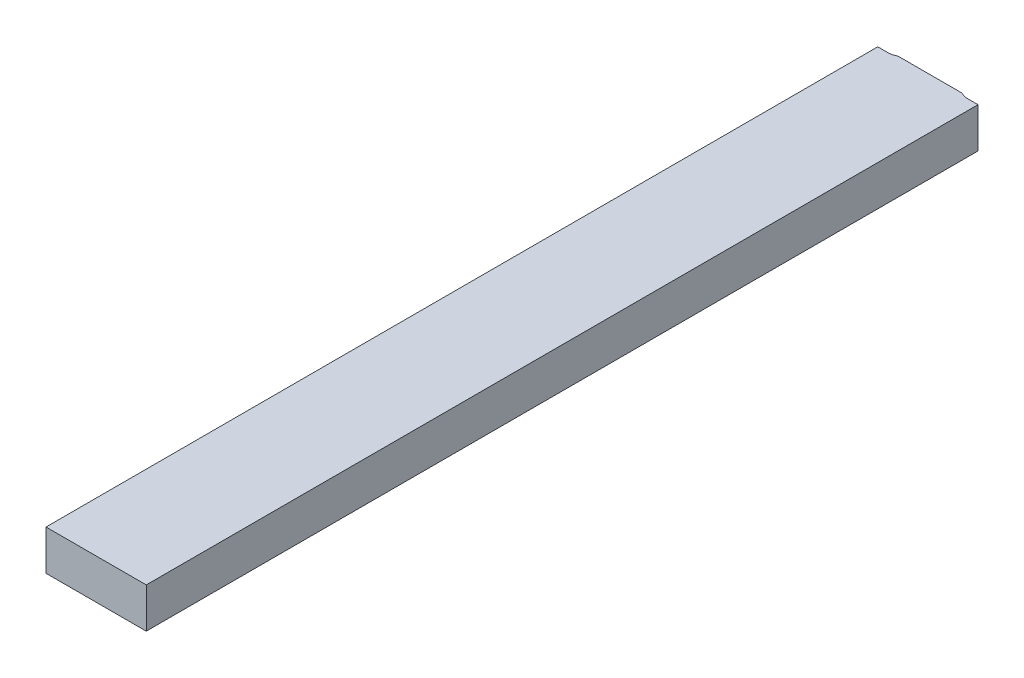
ISO-10303-21;
HEADER;
FILE_DESCRIPTION(('STEP AP214'),'2;1');
FILE_NAME('part.step','',(''),(''),'','','');
FILE_SCHEMA(('AUTOMOTIVE_DESIGN { 1 0 10303 214 1 1 1 1 }'));
ENDSEC;
DATA;
#1=APPLICATION_CONTEXT('core data for automotive mechanical design processes');
#2=APPLICATION_PROTOCOL_DEFINITION('international standard','automotive_design',2000,#1);
#3=PRODUCT_CONTEXT('',#1,'mechanical');
#4=PRODUCT('Part','Part','',(#3));
#5=PRODUCT_RELATED_PRODUCT_CATEGORY('part','',(#4));
#6=PRODUCT_DEFINITION_FORMATION('','',#4);
#7=PRODUCT_DEFINITION_CONTEXT('part definition',#1,'design');
#8=PRODUCT_DEFINITION('design','',#6,#7);
#9=PRODUCT_DEFINITION_SHAPE('','',#8);
#10=(LENGTH_UNIT() NAMED_UNIT(*) SI_UNIT(.MILLI.,.METRE.));
#11=(NAMED_UNIT(*) PLANE_ANGLE_UNIT() SI_UNIT($,.RADIAN.));
#12=(NAMED_UNIT(*) SI_UNIT($,.STERADIAN.) SOLID_ANGLE_UNIT());
#13=UNCERTAINTY_MEASURE_WITH_UNIT(LENGTH_MEASURE(1.E-05),#10,'distance_accuracy_value','');
#14=(GEOMETRIC_REPRESENTATION_CONTEXT(3) GLOBAL_UNCERTAINTY_ASSIGNED_CONTEXT((#13)) GLOBAL_UNIT_ASSIGNED_CONTEXT((#10,
#11,#12)) REPRESENTATION_CONTEXT('',''));
#15=CARTESIAN_POINT('',(0.,0.,0.));
#16=DIRECTION('',(0.,0.,1.));
#17=DIRECTION('',(1.,0.,0.));
#18=AXIS2_PLACEMENT_3D('',#15,#16,#17);
#19=CARTESIAN_POINT('',(-0.5,0.275,-4.982138483572));
#20=DIRECTION('',(0.,1.,0.));
#21=DIRECTION('',(0.,0.,1.));
#22=AXIS2_PLACEMENT_3D('',#19,#20,#21);
#23=PLANE('',#22);
#24=DIRECTION('',(1.,0.,0.));
#25=VECTOR('',#24,1.);
#26=CARTESIAN_POINT('',(-0.725,0.275,-7.051158663985));
#27=LINE('',#26,#25);
#28=CARTESIAN_POINT('',(-0.75,0.275,-7.051158663985));
#29=VERTEX_POINT('',#28);
#30=CARTESIAN_POINT('',(-0.69999999999826,0.275,-7.05115866398515));
#31=VERTEX_POINT('',#30);
#32=EDGE_CURVE('E184',#29,#31,#27,.T.);
#33=ORIENTED_EDGE('',*,*,#32,.T.);
#34=CARTESIAN_POINT('',(-0.660743906178976,0.275,-7.06145062487896));
#35=CARTESIAN_POINT('',(-0.66430562065385,0.275,-7.05943829430757));
#36=CARTESIAN_POINT('',(-0.668023085412866,0.275,-7.05770911017002));
#37=CARTESIAN_POINT('',(-0.675678668397967,0.275,-7.05483826909006));
#38=CARTESIAN_POINT('',(-0.6796167866928,0.275,-7.05369661233069));
#39=CARTESIAN_POINT('',(-0.688999406113005,0.275,-7.05173413514555));
#40=CARTESIAN_POINT('',(-0.694496220016045,0.275,-7.05115865434738));
#41=CARTESIAN_POINT('',(-0.699999999996518,0.275,-7.0511586639853));
#42=B_SPLINE_CURVE_WITH_KNOTS('',3,(#34,#35,#36,#37,#38,#39,#40,#41),.UNSPECIFIED.,.F.,.F.,(4,2,
2,4),(0.,0.0122542009828395,0.0245084057837014,0.0409766482848037),.UNSPECIFIED.);
#43=CARTESIAN_POINT('',(-0.660743906178977,0.275,-7.06145062487897));
#44=VERTEX_POINT('',#43);
#45=EDGE_CURVE('E93',#44,#31,#42,.T.);
#46=ORIENTED_EDGE('',*,*,#45,.F.);
#47=DIRECTION('',(1.,0.,0.));
#48=VECTOR('',#47,1.);
#49=CARTESIAN_POINT('',(-0.4999999517955,0.275,-7.061450624879));
#50=LINE('',#49,#48);
#51=CARTESIAN_POINT('',(-0.339255997411955,0.275,-7.06145062487907));
#52=VERTEX_POINT('',#51);
#53=EDGE_CURVE('E89',#44,#52,#50,.T.);
#54=ORIENTED_EDGE('',*,*,#53,.T.);
#55=CARTESIAN_POINT('',(-0.30000000000351,0.275,-7.05115866398509));
#56=CARTESIAN_POINT('',(-0.304088792772763,0.275,-7.05116284562048));
#57=CARTESIAN_POINT('',(-0.308176113333518,0.275,-7.05148113218099));
#58=CARTESIAN_POINT('',(-0.316256674158179,0.275,-7.05273057454795));
#59=CARTESIAN_POINT('',(-0.32024989952291,0.275,-7.0536618267458));
#60=CARTESIAN_POINT('',(-0.329390827665484,0.275,-7.05654480111919));
#61=CARTESIAN_POINT('',(-0.33446335028931,0.275,-7.05873731135745));
#62=CARTESIAN_POINT('',(-0.33925599741191,0.275,-7.06145062487915));
#63=B_SPLINE_CURVE_WITH_KNOTS('',3,(#55,#56,#57,#58,#59,#60,#61,#62),.UNSPECIFIED.,.F.,.F.,(4,2,
2,4),(0.,0.012252737975001,0.0245074032043933,0.0409759652393869),.UNSPECIFIED.);
#64=CARTESIAN_POINT('',(-0.300000000001755,0.275,-7.05115866398504));
#65=VERTEX_POINT('',#64);
#66=EDGE_CURVE('E21',#65,#52,#63,.T.);
#67=ORIENTED_EDGE('',*,*,#66,.F.);
#68=DIRECTION('',(1.,0.,0.));
#69=VECTOR('',#68,1.);
#70=CARTESIAN_POINT('',(-0.275,0.275,-7.051158663985));
#71=LINE('',#70,#69);
#72=CARTESIAN_POINT('',(-0.25,0.275,-7.051158663985));
#73=VERTEX_POINT('',#72);
#74=EDGE_CURVE('E84',#65,#73,#71,.T.);
#75=ORIENTED_EDGE('',*,*,#74,.T.);
#76=DIRECTION('',(0.,0.,-1.));
#77=VECTOR('',#76,1.);
#78=CARTESIAN_POINT('',(-0.25,0.275,-4.976992503125));
#79=LINE('',#78,#77);
#80=CARTESIAN_POINT('',(-0.25,0.275,-2.902826342264));
#81=VERTEX_POINT('',#80);
#82=EDGE_CURVE('E218',#81,#73,#79,.T.);
#83=ORIENTED_EDGE('',*,*,#82,.F.);
#84=DIRECTION('',(1.,0.,0.));
#85=VECTOR('',#84,1.);
#86=CARTESIAN_POINT('',(-0.5,0.275,-2.902826342264));
#87=LINE('',#86,#85);
#88=CARTESIAN_POINT('',(-0.75,0.275,-2.902826342264));
#89=VERTEX_POINT('',#88);
#90=EDGE_CURVE('E204',#89,#81,#87,.T.);
#91=ORIENTED_EDGE('',*,*,#90,.F.);
#92=DIRECTION('',(0.,0.,-1.));
#93=VECTOR('',#92,1.);
#94=CARTESIAN_POINT('',(-0.75,0.275,-4.976992503125));
#95=LINE('',#94,#93);
#96=EDGE_CURVE('E176',#89,#29,#95,.T.);
#97=ORIENTED_EDGE('',*,*,#96,.T.);
#98=EDGE_LOOP('',(#33,#46,#54,#67,#75,#83,#91,#97));
#99=FACE_BOUND('',#98,.T.);
#100=ADVANCED_FACE('F17',(#99),#23,.F.);
#101=CARTESIAN_POINT('',(-0.25,0.375,-4.976992503125));
#102=DIRECTION('',(1.,0.,0.));
#103=DIRECTION('',(0.,0.,-1.));
#104=AXIS2_PLACEMENT_3D('',#101,#102,#103);
#105=PLANE('',#104);
#106=DIRECTION('',(0.,0.,1.));
#107=VECTOR('',#106,1.);
#108=CARTESIAN_POINT('',(-0.25,0.475,-4.982138483571));
#109=LINE('',#108,#107);
#110=CARTESIAN_POINT('',(-0.25,0.475,-2.902826342264));
#111=VERTEX_POINT('',#110);
#112=CARTESIAN_POINT('',(-0.25,0.475,-7.051158663985));
#113=VERTEX_POINT('',#112);
#114=EDGE_CURVE('E189',#111,#113,#109,.F.);
#115=ORIENTED_EDGE('',*,*,#114,.F.);
#116=DIRECTION('',(0.,1.,0.));
#117=VECTOR('',#116,1.);
#118=CARTESIAN_POINT('',(-0.25,0.375,-2.902826342264));
#119=LINE('',#118,#117);
#120=EDGE_CURVE('E203',#81,#111,#119,.T.);
#121=ORIENTED_EDGE('',*,*,#120,.F.);
#122=ORIENTED_EDGE('',*,*,#82,.T.);
#123=DIRECTION('',(0.,1.,0.));
#124=VECTOR('',#123,1.);
#125=CARTESIAN_POINT('',(-0.25,0.375,-7.051158663985));
#126=LINE('',#125,#124);
#127=EDGE_CURVE('E233',#73,#113,#126,.T.);
#128=ORIENTED_EDGE('',*,*,#127,.T.);
#129=EDGE_LOOP('',(#115,#121,#122,#128));
#130=FACE_BOUND('',#129,.T.);
#131=ADVANCED_FACE('F238',(#130),#105,.T.);
#132=CARTESIAN_POINT('',(-0.275,0.375,-7.051158663985));
#133=DIRECTION('',(0.,0.,1.));
#134=DIRECTION('',(1.,0.,0.));
#135=AXIS2_PLACEMENT_3D('',#132,#133,#134);
#136=PLANE('',#135);
#137=DIRECTION('',(1.,0.,0.));
#138=VECTOR('',#137,1.);
#139=CARTESIAN_POINT('',(-0.5,0.475,-7.051158663985));
#140=LINE('',#139,#138);
#141=CARTESIAN_POINT('',(-0.300000073359329,0.475,-7.05115866418437));
#142=VERTEX_POINT('',#141);
#143=EDGE_CURVE('E135',#113,#142,#140,.F.);
#144=ORIENTED_EDGE('',*,*,#143,.F.);
#145=ORIENTED_EDGE('',*,*,#127,.F.);
#146=ORIENTED_EDGE('',*,*,#74,.F.);
#147=DIRECTION('',(0.,1.,0.));
#148=VECTOR('',#147,1.);
#149=CARTESIAN_POINT('',(-0.3,0.2699679840491,-7.05115866398508));
#150=LINE('',#149,#148);
#151=EDGE_CURVE('E103',#142,#65,#150,.F.);
#152=ORIENTED_EDGE('',*,*,#151,.F.);
#153=EDGE_LOOP('',(#144,#145,#146,#152));
#154=FACE_BOUND('',#153,.T.);
#155=ADVANCED_FACE('F125',(#154),#136,.F.);
#156=CARTESIAN_POINT('',(-0.29748039058,0.2699679840491,-7.051190309039));
#157=CARTESIAN_POINT('',(-0.2983195823803,0.2699679840491,-7.051166943388));
#158=CARTESIAN_POINT('',(-0.3043849976371,0.2699679840491,-7.051090682037));
#159=CARTESIAN_POINT('',(-0.315708586206,0.2699679840491,-7.052195104335));
#160=CARTESIAN_POINT('',(-0.3288586496651,0.2699679840491,-7.056177217872));
#161=CARTESIAN_POINT('',(-0.3379758778506,0.2699679840491,-7.060613467733));
#162=CARTESIAN_POINT('',(-0.3421574979326,0.2699679840491,-7.063145821386));
#163=CARTESIAN_POINT('',(-0.3435662226972,0.2699679840491,-7.064061090589));
#164=(BOUNDED_CURVE() B_SPLINE_CURVE(3,(#156,#157,#158,#159,#160,#161,#162,#163),.UNSPECIFIED.,
.F.,.F.) B_SPLINE_CURVE_WITH_KNOTS((4,1,1,1,1,4),(0.,0.05196482602428,0.3752098129413,
0.6983604955043,0.8962889073985,1.),
.UNSPECIFIED.) CURVE() GEOMETRIC_REPRESENTATION_ITEM() RATIONAL_B_SPLINE_CURVE((1.,1.,1.,1.,1.,
1.,1.,1.)) REPRESENTATION_ITEM(''));
#165=DIRECTION('',(0.,1.,0.));
#166=VECTOR('',#165,1.);
#167=SURFACE_OF_LINEAR_EXTRUSION('',#164,#166);
#168=ORIENTED_EDGE('',*,*,#66,.T.);
#169=DIRECTION('',(0.,1.,0.));
#170=VECTOR('',#169,1.);
#171=CARTESIAN_POINT('',(-0.339255997412,0.375,-7.061450624879));
#172=LINE('',#171,#170);
#173=CARTESIAN_POINT('',(-0.339255997412,0.475,-7.061450624879));
#174=VERTEX_POINT('',#173);
#175=EDGE_CURVE('E97',#52,#174,#172,.T.);
#176=ORIENTED_EDGE('',*,*,#175,.T.);
#177=CARTESIAN_POINT('',(-0.300000146718659,0.475,-7.05115866438369));
#178=CARTESIAN_POINT('',(-0.304088939481711,0.475,-7.05116285322031));
#179=CARTESIAN_POINT('',(-0.308176259487891,0.475,-7.05148114713333));
#180=CARTESIAN_POINT('',(-0.316256818064435,0.475,-7.05273060421154));
#181=CARTESIAN_POINT('',(-0.320250041735423,0.475,-7.05366186376825));
#182=CARTESIAN_POINT('',(-0.329390918061579,0.475,-7.05654484039361));
#183=CARTESIAN_POINT('',(-0.334463393072713,0.475,-7.05873733584118));
#184=CARTESIAN_POINT('',(-0.339255997411909,0.475,-7.06145062487915));
#185=B_SPLINE_CURVE_WITH_KNOTS('',3,(#177,#178,#179,#180,#181,#182,#183,#184),.UNSPECIFIED.,.F.,
.F.,(4,2,2,4),(0.,0.0122527379884341,0.0245074032338869,0.0409758193004471),.UNSPECIFIED.);
#186=EDGE_CURVE('E129',#142,#174,#185,.T.);
#187=ORIENTED_EDGE('',*,*,#186,.F.);
#188=ORIENTED_EDGE('',*,*,#151,.T.);
#189=EDGE_LOOP('',(#168,#176,#187,#188));
#190=FACE_BOUND('',#189,.T.);
#191=ADVANCED_FACE('F100',(#190),#167,.T.);
#192=CARTESIAN_POINT('',(-0.4999999517955,0.375,-7.061450624879));
#193=DIRECTION('',(0.,0.,1.));
#194=DIRECTION('',(1.,0.,0.));
#195=AXIS2_PLACEMENT_3D('',#192,#193,#194);
#196=PLANE('',#195);
#197=ORIENTED_EDGE('',*,*,#53,.F.);
#198=DIRECTION('',(0.,1.,0.));
#199=VECTOR('',#198,1.);
#200=CARTESIAN_POINT('',(-0.660743906178977,0.2699679840491,-7.06145062487896));
#201=LINE('',#200,#199);
#202=CARTESIAN_POINT('',(-0.660743906178978,0.475,-7.06145062487897));
#203=VERTEX_POINT('',#202);
#204=EDGE_CURVE('E109',#203,#44,#201,.F.);
#205=ORIENTED_EDGE('',*,*,#204,.F.);
#206=DIRECTION('',(1.,0.,0.));
#207=VECTOR('',#206,1.);
#208=CARTESIAN_POINT('',(-0.5,0.475,-7.061450624879));
#209=LINE('',#208,#207);
#210=EDGE_CURVE('E106',#174,#203,#209,.F.);
#211=ORIENTED_EDGE('',*,*,#210,.F.);
#212=ORIENTED_EDGE('',*,*,#175,.F.);
#213=EDGE_LOOP('',(#197,#205,#211,#212));
#214=FACE_BOUND('',#213,.T.);
#215=ADVANCED_FACE('F104',(#214),#196,.F.);
#216=CARTESIAN_POINT('',(-0.6564336924592,0.2699679840491,-7.064061118802));
#217=CARTESIAN_POINT('',(-0.6578424137901,0.2699679840491,-7.063145841608));
#218=CARTESIAN_POINT('',(-0.6620218926685,0.2699679840491,-7.060614746012));
#219=CARTESIAN_POINT('',(-0.6711380151204,0.2699679840491,-7.056178456814));
#220=CARTESIAN_POINT('',(-0.684287959398,0.2699679840491,-7.052195755785));
#221=CARTESIAN_POINT('',(-0.6956132537289,0.2699679840491,-7.051090694486));
#222=CARTESIAN_POINT('',(-0.7016788682183,0.2699679840491,-7.051166937919));
#223=CARTESIAN_POINT('',(-0.7025172883639,0.2699679840491,-7.051190272618));
#224=(BOUNDED_CURVE() B_SPLINE_CURVE(3,(#216,#217,#218,#219,#220,#221,#222,#223),.UNSPECIFIED.,
.F.,.F.) B_SPLINE_CURVE_WITH_KNOTS((4,1,1,1,1,4),(0.,0.10371588788,0.301499879474,
0.6247605212805,0.9480806664219,1.),
.UNSPECIFIED.) CURVE() GEOMETRIC_REPRESENTATION_ITEM() RATIONAL_B_SPLINE_CURVE((1.,1.,1.,1.,1.,
1.,1.,1.)) REPRESENTATION_ITEM(''));
#225=DIRECTION('',(0.,1.,0.));
#226=VECTOR('',#225,1.);
#227=SURFACE_OF_LINEAR_EXTRUSION('',#224,#226);
#228=CARTESIAN_POINT('',(-0.660743906178979,0.475,-7.06145062487895));
#229=CARTESIAN_POINT('',(-0.664305620630967,0.475,-7.05943829433276));
#230=CARTESIAN_POINT('',(-0.668023085401427,0.475,-7.05770911018262));
#231=CARTESIAN_POINT('',(-0.675678668409414,0.475,-7.05483826907746));
#232=CARTESIAN_POINT('',(-0.67961678671569,0.475,-7.05369661230549));
#233=CARTESIAN_POINT('',(-0.688999358368212,0.475,-7.05173414515933));
#234=CARTESIAN_POINT('',(-0.694496122385205,0.475,-7.05115866469179));
#235=CARTESIAN_POINT('',(-0.69999985318857,0.475,-7.05115866438328));
#236=B_SPLINE_CURVE_WITH_KNOTS('',3,(#228,#229,#230,#231,#232,#233,#234,#235),.UNSPECIFIED.,.F.,
.F.,(4,2,2,4),(0.,0.0122542009828397,0.0245084057837016,0.0409765022206851),.UNSPECIFIED.);
#237=CARTESIAN_POINT('',(-0.7,0.475,-7.051158663985));
#238=VERTEX_POINT('',#237);
#239=EDGE_CURVE('E136',#203,#238,#236,.T.);
#240=ORIENTED_EDGE('',*,*,#239,.F.);
#241=ORIENTED_EDGE('',*,*,#204,.T.);
#242=ORIENTED_EDGE('',*,*,#45,.T.);
#243=DIRECTION('',(0.,1.,0.));
#244=VECTOR('',#243,1.);
#245=CARTESIAN_POINT('',(-0.7,0.375,-7.051158663985));
#246=LINE('',#245,#244);
#247=EDGE_CURVE('E182',#31,#238,#246,.T.);
#248=ORIENTED_EDGE('',*,*,#247,.T.);
#249=EDGE_LOOP('',(#240,#241,#242,#248));
#250=FACE_BOUND('',#249,.T.);
#251=ADVANCED_FACE('F159',(#250),#227,.T.);
#252=CARTESIAN_POINT('',(-0.725,0.375,-7.051158663985));
#253=DIRECTION('',(0.,0.,1.));
#254=DIRECTION('',(1.,0.,0.));
#255=AXIS2_PLACEMENT_3D('',#252,#253,#254);
#256=PLANE('',#255);
#257=DIRECTION('',(1.,0.,0.));
#258=VECTOR('',#257,1.);
#259=CARTESIAN_POINT('',(-0.5,0.475,-7.051158663985));
#260=LINE('',#259,#258);
#261=CARTESIAN_POINT('',(-0.75,0.475,-7.051158663985));
#262=VERTEX_POINT('',#261);
#263=EDGE_CURVE('E181',#238,#262,#260,.F.);
#264=ORIENTED_EDGE('',*,*,#263,.F.);
#265=ORIENTED_EDGE('',*,*,#247,.F.);
#266=ORIENTED_EDGE('',*,*,#32,.F.);
#267=DIRECTION('',(0.,1.,0.));
#268=VECTOR('',#267,1.);
#269=CARTESIAN_POINT('',(-0.75,0.375,-7.051158663985));
#270=LINE('',#269,#268);
#271=EDGE_CURVE('E174',#29,#262,#270,.T.);
#272=ORIENTED_EDGE('',*,*,#271,.T.);
#273=EDGE_LOOP('',(#264,#265,#266,#272));
#274=FACE_BOUND('',#273,.T.);
#275=ADVANCED_FACE('F157',(#274),#256,.F.);
#276=CARTESIAN_POINT('',(-0.75,0.375,-4.976992503125));
#277=DIRECTION('',(1.,0.,0.));
#278=DIRECTION('',(0.,0.,-1.));
#279=AXIS2_PLACEMENT_3D('',#276,#277,#278);
#280=PLANE('',#279);
#281=ORIENTED_EDGE('',*,*,#271,.F.);
#282=ORIENTED_EDGE('',*,*,#96,.F.);
#283=DIRECTION('',(0.,1.,0.));
#284=VECTOR('',#283,1.);
#285=CARTESIAN_POINT('',(-0.75,0.375,-2.902826342264));
#286=LINE('',#285,#284);
#287=CARTESIAN_POINT('',(-0.75,0.475,-2.902826342264));
#288=VERTEX_POINT('',#287);
#289=EDGE_CURVE('E40',#288,#89,#286,.F.);
#290=ORIENTED_EDGE('',*,*,#289,.F.);
#291=DIRECTION('',(0.,0.,1.));
#292=VECTOR('',#291,1.);
#293=CARTESIAN_POINT('',(-0.75,0.475,-4.982138483571));
#294=LINE('',#293,#292);
#295=EDGE_CURVE('E31',#262,#288,#294,.T.);
#296=ORIENTED_EDGE('',*,*,#295,.F.);
#297=EDGE_LOOP('',(#281,#282,#290,#296));
#298=FACE_BOUND('',#297,.T.);
#299=ADVANCED_FACE('F153',(#298),#280,.F.);
#300=CARTESIAN_POINT('',(-0.5,0.375,-2.902826342264));
#301=DIRECTION('',(0.,0.,1.));
#302=DIRECTION('',(1.,0.,0.));
#303=AXIS2_PLACEMENT_3D('',#300,#301,#302);
#304=PLANE('',#303);
#305=ORIENTED_EDGE('',*,*,#120,.T.);
#306=DIRECTION('',(1.,0.,0.));
#307=VECTOR('',#306,1.);
#308=CARTESIAN_POINT('',(-0.5,0.475,-2.902826342264));
#309=LINE('',#308,#307);
#310=EDGE_CURVE('E11',#288,#111,#309,.T.);
#311=ORIENTED_EDGE('',*,*,#310,.F.);
#312=ORIENTED_EDGE('',*,*,#289,.T.);
#313=ORIENTED_EDGE('',*,*,#90,.T.);
#314=EDGE_LOOP('',(#305,#311,#312,#313));
#315=FACE_BOUND('',#314,.T.);
#316=ADVANCED_FACE('F148',(#315),#304,.T.);
#317=CARTESIAN_POINT('',(-0.5,0.475,-4.982138483571));
#318=DIRECTION('',(0.,1.,0.));
#319=DIRECTION('',(0.,0.,1.));
#320=AXIS2_PLACEMENT_3D('',#317,#318,#319);
#321=PLANE('',#320);
#322=ORIENTED_EDGE('',*,*,#295,.T.);
#323=ORIENTED_EDGE('',*,*,#310,.T.);
#324=ORIENTED_EDGE('',*,*,#114,.T.);
#325=ORIENTED_EDGE('',*,*,#143,.T.);
#326=ORIENTED_EDGE('',*,*,#186,.T.);
#327=ORIENTED_EDGE('',*,*,#210,.T.);
#328=ORIENTED_EDGE('',*,*,#239,.T.);
#329=ORIENTED_EDGE('',*,*,#263,.T.);
#330=EDGE_LOOP('',(#322,#323,#324,#325,#326,#327,#328,#329));
#331=FACE_BOUND('',#330,.T.);
#332=ADVANCED_FACE('F144',(#331),#321,.T.);
#333=CLOSED_SHELL('',(#100,#131,#155,#191,#215,#251,#275,#299,#316,#332));
#334=MANIFOLD_SOLID_BREP('B1',#333);
#335=ADVANCED_BREP_SHAPE_REPRESENTATION('',(#18,#334),#14);
#336=SHAPE_DEFINITION_REPRESENTATION(#9,#335);
ENDSEC;
END-ISO-10303-21;
